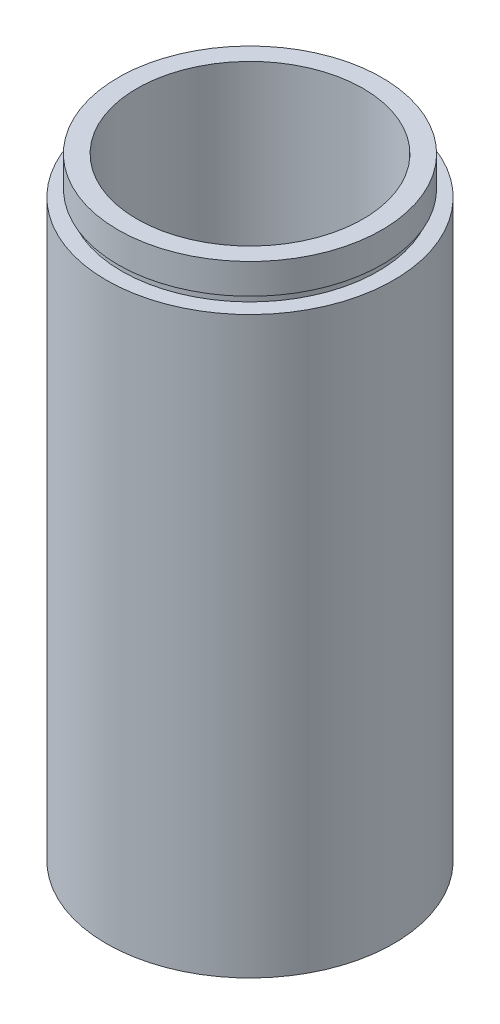
ISO-10303-21;
HEADER;
FILE_DESCRIPTION(('STEP AP214'),'2;1');
FILE_NAME('part.step','',(''),(''),'','','');
FILE_SCHEMA(('AUTOMOTIVE_DESIGN { 1 0 10303 214 1 1 1 1 }'));
ENDSEC;
DATA;
#1=APPLICATION_CONTEXT('core data for automotive mechanical design processes');
#2=APPLICATION_PROTOCOL_DEFINITION('international standard','automotive_design',2000,#1);
#3=PRODUCT_CONTEXT('',#1,'mechanical');
#4=PRODUCT('Part','Part','',(#3));
#5=PRODUCT_RELATED_PRODUCT_CATEGORY('part','',(#4));
#6=PRODUCT_DEFINITION_FORMATION('','',#4);
#7=PRODUCT_DEFINITION_CONTEXT('part definition',#1,'design');
#8=PRODUCT_DEFINITION('design','',#6,#7);
#9=PRODUCT_DEFINITION_SHAPE('','',#8);
#10=(LENGTH_UNIT() NAMED_UNIT(*) SI_UNIT(.MILLI.,.METRE.));
#11=(NAMED_UNIT(*) PLANE_ANGLE_UNIT() SI_UNIT($,.RADIAN.));
#12=(NAMED_UNIT(*) SI_UNIT($,.STERADIAN.) SOLID_ANGLE_UNIT());
#13=UNCERTAINTY_MEASURE_WITH_UNIT(LENGTH_MEASURE(1.E-05),#10,'distance_accuracy_value','');
#14=(GEOMETRIC_REPRESENTATION_CONTEXT(3) GLOBAL_UNCERTAINTY_ASSIGNED_CONTEXT((#13)) GLOBAL_UNIT_ASSIGNED_CONTEXT((#10,
#11,#12)) REPRESENTATION_CONTEXT('',''));
#15=CARTESIAN_POINT('',(0.,0.,0.));
#16=DIRECTION('',(0.,0.,1.));
#17=DIRECTION('',(1.,0.,0.));
#18=AXIS2_PLACEMENT_3D('',#15,#16,#17);
#19=CARTESIAN_POINT('',(17.,0.,0.));
#20=DIRECTION('',(0.,1.,0.));
#21=DIRECTION('',(0.,0.,1.));
#22=AXIS2_PLACEMENT_3D('',#19,#20,#21);
#23=PLANE('',#22);
#24=CARTESIAN_POINT('',(0.,0.,0.));
#25=DIRECTION('',(0.,1.,0.));
#26=DIRECTION('',(0.,0.,1.));
#27=AXIS2_PLACEMENT_3D('',#24,#25,#26);
#28=CIRCLE('',#27,19.05);
#29=CARTESIAN_POINT('',(0.,0.,19.05));
#30=VERTEX_POINT('',#29);
#31=EDGE_CURVE('E10',#30,#30,#28,.T.);
#32=ORIENTED_EDGE('',*,*,#31,.F.);
#33=EDGE_LOOP('',(#32));
#34=FACE_BOUND('',#33,.T.);
#35=CARTESIAN_POINT('',(0.,0.,0.));
#36=DIRECTION('',(0.,1.,0.));
#37=DIRECTION('',(0.,0.,1.));
#38=AXIS2_PLACEMENT_3D('',#35,#36,#37);
#39=CIRCLE('',#38,17.);
#40=CARTESIAN_POINT('',(0.,0.,17.));
#41=VERTEX_POINT('',#40);
#42=EDGE_CURVE('E75',#41,#41,#39,.T.);
#43=ORIENTED_EDGE('',*,*,#42,.T.);
#44=EDGE_LOOP('',(#43));
#45=FACE_BOUND('',#44,.T.);
#46=ADVANCED_FACE('F35',(#34,#45),#23,.F.);
#47=CARTESIAN_POINT('',(0.,161.376166943427,0.));
#48=DIRECTION('',(0.,1.,0.));
#49=DIRECTION('',(0.,0.,1.));
#50=AXIS2_PLACEMENT_3D('',#47,#48,#49);
#51=CYLINDRICAL_SURFACE('',#50,19.05);
#52=CARTESIAN_POINT('',(0.,76.2,0.));
#53=DIRECTION('',(0.,1.,0.));
#54=DIRECTION('',(0.,0.,1.));
#55=AXIS2_PLACEMENT_3D('',#52,#53,#54);
#56=CIRCLE('',#55,19.05);
#57=CARTESIAN_POINT('',(0.,76.2,19.05));
#58=VERTEX_POINT('',#57);
#59=EDGE_CURVE('E41',#58,#58,#56,.T.);
#60=ORIENTED_EDGE('',*,*,#59,.F.);
#61=EDGE_LOOP('',(#60));
#62=FACE_BOUND('',#61,.T.);
#63=ORIENTED_EDGE('',*,*,#31,.T.);
#64=EDGE_LOOP('',(#63));
#65=FACE_BOUND('',#64,.T.);
#66=ADVANCED_FACE('F136',(#62,#65),#51,.T.);
#67=CARTESIAN_POINT('',(19.05,76.2,0.));
#68=DIRECTION('',(0.,-1.,0.));
#69=DIRECTION('',(0.,0.,-1.));
#70=AXIS2_PLACEMENT_3D('',#67,#68,#69);
#71=PLANE('',#70);
#72=CARTESIAN_POINT('',(0.,76.2,0.));
#73=DIRECTION('',(0.,1.,0.));
#74=DIRECTION('',(0.,0.,1.));
#75=AXIS2_PLACEMENT_3D('',#72,#73,#74);
#76=CIRCLE('',#75,17.);
#77=CARTESIAN_POINT('',(0.,76.2,17.));
#78=VERTEX_POINT('',#77);
#79=EDGE_CURVE('E45',#78,#78,#76,.T.);
#80=ORIENTED_EDGE('',*,*,#79,.F.);
#81=EDGE_LOOP('',(#80));
#82=FACE_BOUND('',#81,.T.);
#83=ORIENTED_EDGE('',*,*,#59,.T.);
#84=EDGE_LOOP('',(#83));
#85=FACE_BOUND('',#84,.T.);
#86=ADVANCED_FACE('F131',(#82,#85),#71,.F.);
#87=CARTESIAN_POINT('',(0.,161.376166943427,0.));
#88=DIRECTION('',(0.,1.,0.));
#89=DIRECTION('',(0.,0.,1.));
#90=AXIS2_PLACEMENT_3D('',#87,#88,#89);
#91=CYLINDRICAL_SURFACE('',#90,17.);
#92=CARTESIAN_POINT('',(0.,77.2,0.));
#93=DIRECTION('',(0.,1.,0.));
#94=DIRECTION('',(0.,0.,1.));
#95=AXIS2_PLACEMENT_3D('',#92,#93,#94);
#96=CIRCLE('',#95,17.);
#97=CARTESIAN_POINT('',(0.,77.2,17.));
#98=VERTEX_POINT('',#97);
#99=EDGE_CURVE('E49',#98,#98,#96,.T.);
#100=ORIENTED_EDGE('',*,*,#99,.F.);
#101=EDGE_LOOP('',(#100));
#102=FACE_BOUND('',#101,.T.);
#103=ORIENTED_EDGE('',*,*,#79,.T.);
#104=EDGE_LOOP('',(#103));
#105=FACE_BOUND('',#104,.T.);
#106=ADVANCED_FACE('F125',(#102,#105),#91,.T.);
#107=CARTESIAN_POINT('',(17.,77.2,0.));
#108=DIRECTION('',(0.,1.,0.));
#109=DIRECTION('',(0.,0.,1.));
#110=AXIS2_PLACEMENT_3D('',#107,#108,#109);
#111=PLANE('',#110);
#112=CARTESIAN_POINT('',(0.,77.2,0.));
#113=DIRECTION('',(0.,1.,0.));
#114=DIRECTION('',(0.,0.,1.));
#115=AXIS2_PLACEMENT_3D('',#112,#113,#114);
#116=CIRCLE('',#115,17.5);
#117=CARTESIAN_POINT('',(0.,77.2,17.5));
#118=VERTEX_POINT('',#117);
#119=EDGE_CURVE('E54',#118,#118,#116,.T.);
#120=ORIENTED_EDGE('',*,*,#119,.F.);
#121=EDGE_LOOP('',(#120));
#122=FACE_BOUND('',#121,.T.);
#123=ORIENTED_EDGE('',*,*,#99,.T.);
#124=EDGE_LOOP('',(#123));
#125=FACE_BOUND('',#124,.T.);
#126=ADVANCED_FACE('F119',(#122,#125),#111,.F.);
#127=CARTESIAN_POINT('',(0.,161.376166943427,0.));
#128=DIRECTION('',(0.,1.,0.));
#129=DIRECTION('',(0.,0.,1.));
#130=AXIS2_PLACEMENT_3D('',#127,#128,#129);
#131=CYLINDRICAL_SURFACE('',#130,17.5);
#132=CARTESIAN_POINT('',(0.,81.2,0.));
#133=DIRECTION('',(0.,1.,0.));
#134=DIRECTION('',(0.,0.,1.));
#135=AXIS2_PLACEMENT_3D('',#132,#133,#134);
#136=CIRCLE('',#135,17.5);
#137=CARTESIAN_POINT('',(0.,81.2,17.5));
#138=VERTEX_POINT('',#137);
#139=EDGE_CURVE('E57',#138,#138,#136,.T.);
#140=ORIENTED_EDGE('',*,*,#139,.F.);
#141=EDGE_LOOP('',(#140));
#142=FACE_BOUND('',#141,.T.);
#143=ORIENTED_EDGE('',*,*,#119,.T.);
#144=EDGE_LOOP('',(#143));
#145=FACE_BOUND('',#144,.T.);
#146=ADVANCED_FACE('F113',(#142,#145),#131,.T.);
#147=CARTESIAN_POINT('',(17.5,81.2,0.));
#148=DIRECTION('',(0.,-1.,0.));
#149=DIRECTION('',(0.,0.,-1.));
#150=AXIS2_PLACEMENT_3D('',#147,#148,#149);
#151=PLANE('',#150);
#152=CARTESIAN_POINT('',(0.,81.2,0.));
#153=DIRECTION('',(0.,1.,0.));
#154=DIRECTION('',(0.,0.,1.));
#155=AXIS2_PLACEMENT_3D('',#152,#153,#154);
#156=CIRCLE('',#155,15.);
#157=CARTESIAN_POINT('',(0.,81.2,15.));
#158=VERTEX_POINT('',#157);
#159=EDGE_CURVE('E60',#158,#158,#156,.T.);
#160=ORIENTED_EDGE('',*,*,#159,.F.);
#161=EDGE_LOOP('',(#160));
#162=FACE_BOUND('',#161,.T.);
#163=ORIENTED_EDGE('',*,*,#139,.T.);
#164=EDGE_LOOP('',(#163));
#165=FACE_BOUND('',#164,.T.);
#166=ADVANCED_FACE('F107',(#162,#165),#151,.F.);
#167=CARTESIAN_POINT('',(0.,161.376166943427,0.));
#168=DIRECTION('',(0.,1.,0.));
#169=DIRECTION('',(0.,0.,1.));
#170=AXIS2_PLACEMENT_3D('',#167,#168,#169);
#171=CYLINDRICAL_SURFACE('',#170,15.);
#172=CARTESIAN_POINT('',(0.,5.49999999999998,0.));
#173=DIRECTION('',(0.,1.,0.));
#174=DIRECTION('',(0.,0.,1.));
#175=AXIS2_PLACEMENT_3D('',#172,#173,#174);
#176=CIRCLE('',#175,15.);
#177=CARTESIAN_POINT('',(0.,5.49999999999998,15.));
#178=VERTEX_POINT('',#177);
#179=EDGE_CURVE('E63',#178,#178,#176,.T.);
#180=ORIENTED_EDGE('',*,*,#179,.F.);
#181=EDGE_LOOP('',(#180));
#182=FACE_BOUND('',#181,.T.);
#183=ORIENTED_EDGE('',*,*,#159,.T.);
#184=EDGE_LOOP('',(#183));
#185=FACE_BOUND('',#184,.T.);
#186=ADVANCED_FACE('F101',(#182,#185),#171,.F.);
#187=CARTESIAN_POINT('',(17.6,5.49999999999998,0.));
#188=DIRECTION('',(0.,1.,0.));
#189=DIRECTION('',(0.,0.,1.));
#190=AXIS2_PLACEMENT_3D('',#187,#188,#189);
#191=PLANE('',#190);
#192=CARTESIAN_POINT('',(0.,5.49999999999998,0.));
#193=DIRECTION('',(0.,1.,0.));
#194=DIRECTION('',(0.,0.,1.));
#195=AXIS2_PLACEMENT_3D('',#192,#193,#194);
#196=CIRCLE('',#195,17.6);
#197=CARTESIAN_POINT('',(0.,5.49999999999998,17.6));
#198=VERTEX_POINT('',#197);
#199=EDGE_CURVE('E66',#198,#198,#196,.T.);
#200=ORIENTED_EDGE('',*,*,#199,.F.);
#201=EDGE_LOOP('',(#200));
#202=FACE_BOUND('',#201,.T.);
#203=ORIENTED_EDGE('',*,*,#179,.T.);
#204=EDGE_LOOP('',(#203));
#205=FACE_BOUND('',#204,.T.);
#206=ADVANCED_FACE('F95',(#202,#205),#191,.F.);
#207=CARTESIAN_POINT('',(0.,161.376166943427,0.));
#208=DIRECTION('',(0.,1.,0.));
#209=DIRECTION('',(0.,0.,1.));
#210=AXIS2_PLACEMENT_3D('',#207,#208,#209);
#211=CYLINDRICAL_SURFACE('',#210,17.6);
#212=CARTESIAN_POINT('',(0.,4.49999999999998,0.));
#213=DIRECTION('',(0.,1.,0.));
#214=DIRECTION('',(0.,0.,1.));
#215=AXIS2_PLACEMENT_3D('',#212,#213,#214);
#216=CIRCLE('',#215,17.6);
#217=CARTESIAN_POINT('',(0.,4.49999999999998,17.6));
#218=VERTEX_POINT('',#217);
#219=EDGE_CURVE('E69',#218,#218,#216,.T.);
#220=ORIENTED_EDGE('',*,*,#219,.F.);
#221=EDGE_LOOP('',(#220));
#222=FACE_BOUND('',#221,.T.);
#223=ORIENTED_EDGE('',*,*,#199,.T.);
#224=EDGE_LOOP('',(#223));
#225=FACE_BOUND('',#224,.T.);
#226=ADVANCED_FACE('F89',(#222,#225),#211,.F.);
#227=CARTESIAN_POINT('',(17.,4.49999999999998,0.));
#228=DIRECTION('',(0.,-1.,0.));
#229=DIRECTION('',(0.,0.,-1.));
#230=AXIS2_PLACEMENT_3D('',#227,#228,#229);
#231=PLANE('',#230);
#232=CARTESIAN_POINT('',(0.,4.49999999999998,0.));
#233=DIRECTION('',(0.,1.,0.));
#234=DIRECTION('',(0.,0.,1.));
#235=AXIS2_PLACEMENT_3D('',#232,#233,#234);
#236=CIRCLE('',#235,17.);
#237=CARTESIAN_POINT('',(0.,4.49999999999998,17.));
#238=VERTEX_POINT('',#237);
#239=EDGE_CURVE('E72',#238,#238,#236,.T.);
#240=ORIENTED_EDGE('',*,*,#239,.F.);
#241=EDGE_LOOP('',(#240));
#242=FACE_BOUND('',#241,.T.);
#243=ORIENTED_EDGE('',*,*,#219,.T.);
#244=EDGE_LOOP('',(#243));
#245=FACE_BOUND('',#244,.T.);
#246=ADVANCED_FACE('F83',(#242,#245),#231,.F.);
#247=CARTESIAN_POINT('',(0.,161.376166943427,0.));
#248=DIRECTION('',(0.,1.,0.));
#249=DIRECTION('',(0.,0.,1.));
#250=AXIS2_PLACEMENT_3D('',#247,#248,#249);
#251=CYLINDRICAL_SURFACE('',#250,17.);
#252=ORIENTED_EDGE('',*,*,#42,.F.);
#253=EDGE_LOOP('',(#252));
#254=FACE_BOUND('',#253,.T.);
#255=ORIENTED_EDGE('',*,*,#239,.T.);
#256=EDGE_LOOP('',(#255));
#257=FACE_BOUND('',#256,.T.);
#258=ADVANCED_FACE('F80',(#254,#257),#251,.F.);
#259=CLOSED_SHELL('',(#46,#66,#86,#106,#126,#146,#166,#186,#206,#226,#246,#258));
#260=MANIFOLD_SOLID_BREP('B2',#259);
#261=ADVANCED_BREP_SHAPE_REPRESENTATION('',(#18,#260),#14);
#262=SHAPE_DEFINITION_REPRESENTATION(#9,#261);
ENDSEC;
END-ISO-10303-21;
